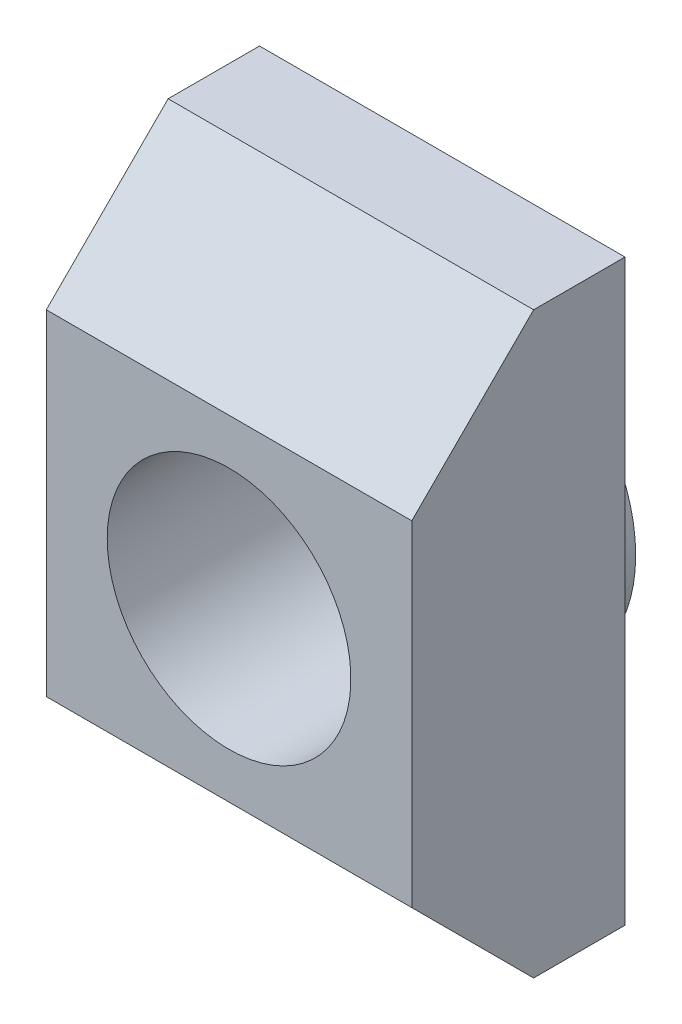
ISO-10303-21;
HEADER;
FILE_DESCRIPTION(('STEP AP214'),'2;1');
FILE_NAME('part.step','',(''),(''),'','','');
FILE_SCHEMA(('AUTOMOTIVE_DESIGN { 1 0 10303 214 1 1 1 1 }'));
ENDSEC;
DATA;
#1=APPLICATION_CONTEXT('core data for automotive mechanical design processes');
#2=APPLICATION_PROTOCOL_DEFINITION('international standard','automotive_design',2000,#1);
#3=PRODUCT_CONTEXT('',#1,'mechanical');
#4=PRODUCT('Part','Part','',(#3));
#5=PRODUCT_RELATED_PRODUCT_CATEGORY('part','',(#4));
#6=PRODUCT_DEFINITION_FORMATION('','',#4);
#7=PRODUCT_DEFINITION_CONTEXT('part definition',#1,'design');
#8=PRODUCT_DEFINITION('design','',#6,#7);
#9=PRODUCT_DEFINITION_SHAPE('','',#8);
#10=(LENGTH_UNIT() NAMED_UNIT(*) SI_UNIT(.MILLI.,.METRE.));
#11=(NAMED_UNIT(*) PLANE_ANGLE_UNIT() SI_UNIT($,.RADIAN.));
#12=(NAMED_UNIT(*) SI_UNIT($,.STERADIAN.) SOLID_ANGLE_UNIT());
#13=UNCERTAINTY_MEASURE_WITH_UNIT(LENGTH_MEASURE(1.E-05),#10,'distance_accuracy_value','');
#14=(GEOMETRIC_REPRESENTATION_CONTEXT(3) GLOBAL_UNCERTAINTY_ASSIGNED_CONTEXT((#13)) GLOBAL_UNIT_ASSIGNED_CONTEXT((#10,
#11,#12)) REPRESENTATION_CONTEXT('',''));
#15=CARTESIAN_POINT('',(0.,0.,0.));
#16=DIRECTION('',(0.,0.,1.));
#17=DIRECTION('',(1.,0.,0.));
#18=AXIS2_PLACEMENT_3D('',#15,#16,#17);
#19=CARTESIAN_POINT('',(0.,0.,2.92902435331399));
#20=DIRECTION('',(0.,0.,-1.));
#21=DIRECTION('',(-1.,0.,0.));
#22=AXIS2_PLACEMENT_3D('',#19,#20,#21);
#23=CYLINDRICAL_SURFACE('',#22,2.);
#24=CARTESIAN_POINT('',(0.,0.,-1.4372505879018));
#25=DIRECTION('',(0.,0.,-1.));
#26=DIRECTION('',(-1.,0.,0.));
#27=AXIS2_PLACEMENT_3D('',#24,#25,#26);
#28=CIRCLE('',#27,2.);
#29=CARTESIAN_POINT('',(-2.,0.,-1.4372505879018));
#30=VERTEX_POINT('',#29);
#31=EDGE_CURVE('E20',#30,#30,#28,.F.);
#32=ORIENTED_EDGE('',*,*,#31,.F.);
#33=EDGE_LOOP('',(#32));
#34=FACE_BOUND('',#33,.T.);
#35=CARTESIAN_POINT('',(0.,0.,2.6627494120982));
#36=DIRECTION('',(0.,0.,-1.));
#37=DIRECTION('',(-1.,0.,0.));
#38=AXIS2_PLACEMENT_3D('',#35,#36,#37);
#39=CIRCLE('',#38,2.);
#40=CARTESIAN_POINT('',(-2.,0.,2.6627494120982));
#41=VERTEX_POINT('',#40);
#42=EDGE_CURVE('E104',#41,#41,#39,.F.);
#43=ORIENTED_EDGE('',*,*,#42,.T.);
#44=EDGE_LOOP('',(#43));
#45=FACE_BOUND('',#44,.T.);
#46=ADVANCED_FACE('F17',(#34,#45),#23,.F.);
#47=CARTESIAN_POINT('',(0.,0.,-1.4372505879018));
#48=DIRECTION('',(0.,0.,-1.));
#49=DIRECTION('',(-1.,0.,0.));
#50=AXIS2_PLACEMENT_3D('',#47,#48,#49);
#51=PLANE('',#50);
#52=ORIENTED_EDGE('',*,*,#31,.T.);
#53=EDGE_LOOP('',(#52));
#54=FACE_BOUND('',#53,.T.);
#55=CARTESIAN_POINT('',(0.,0.,-1.4372505879018));
#56=DIRECTION('',(0.,0.,1.));
#57=DIRECTION('',(1.,0.,0.));
#58=AXIS2_PLACEMENT_3D('',#55,#56,#57);
#59=CIRCLE('',#58,2.57531937284929);
#60=CARTESIAN_POINT('',(2.57531937284929,0.,-1.4372505879018));
#61=VERTEX_POINT('',#60);
#62=EDGE_CURVE('E83',#61,#61,#59,.T.);
#63=ORIENTED_EDGE('',*,*,#62,.F.);
#64=EDGE_LOOP('',(#63));
#65=FACE_BOUND('',#64,.T.);
#66=ADVANCED_FACE('F116',(#54,#65),#51,.T.);
#67=CARTESIAN_POINT('',(3.,4.75,0.662749412098202));
#68=DIRECTION('',(0.,-0.707106781186548,-0.707106781186548));
#69=DIRECTION('',(0.,0.707106781186548,-0.707106781186548));
#70=AXIS2_PLACEMENT_3D('',#67,#68,#69);
#71=PLANE('',#70);
#72=DIRECTION('',(-1.,0.,0.));
#73=VECTOR('',#72,1.);
#74=CARTESIAN_POINT('',(3.,2.75,2.6627494120982));
#75=LINE('',#74,#73);
#76=CARTESIAN_POINT('',(-3.,2.75,2.6627494120982));
#77=VERTEX_POINT('',#76);
#78=CARTESIAN_POINT('',(3.,2.75,2.6627494120982));
#79=VERTEX_POINT('',#78);
#80=EDGE_CURVE('E102',#77,#79,#75,.F.);
#81=ORIENTED_EDGE('',*,*,#80,.T.);
#82=DIRECTION('',(0.,-0.707106781186548,0.707106781186547));
#83=VECTOR('',#82,1.);
#84=CARTESIAN_POINT('',(3.,4.75,0.662749412098202));
#85=LINE('',#84,#83);
#86=CARTESIAN_POINT('',(3.,4.75,0.662749412098202));
#87=VERTEX_POINT('',#86);
#88=EDGE_CURVE('E66',#87,#79,#85,.T.);
#89=ORIENTED_EDGE('',*,*,#88,.F.);
#90=DIRECTION('',(1.,0.,0.));
#91=VECTOR('',#90,1.);
#92=CARTESIAN_POINT('',(3.,4.75,0.662749412098202));
#93=LINE('',#92,#91);
#94=CARTESIAN_POINT('',(-3.,4.75,0.662749412098202));
#95=VERTEX_POINT('',#94);
#96=EDGE_CURVE('E167',#87,#95,#93,.F.);
#97=ORIENTED_EDGE('',*,*,#96,.T.);
#98=DIRECTION('',(0.,-0.707106781186548,0.707106781186547));
#99=VECTOR('',#98,1.);
#100=CARTESIAN_POINT('',(-3.,4.75,0.662749412098202));
#101=LINE('',#100,#99);
#102=EDGE_CURVE('E161',#95,#77,#101,.T.);
#103=ORIENTED_EDGE('',*,*,#102,.T.);
#104=EDGE_LOOP('',(#81,#89,#97,#103));
#105=FACE_BOUND('',#104,.T.);
#106=ADVANCED_FACE('F124',(#105),#71,.F.);
#107=CARTESIAN_POINT('',(3.,2.75,2.6627494120982));
#108=DIRECTION('',(0.,0.,-1.));
#109=DIRECTION('',(-1.,0.,0.));
#110=AXIS2_PLACEMENT_3D('',#107,#108,#109);
#111=PLANE('',#110);
#112=DIRECTION('',(1.,0.,0.));
#113=VECTOR('',#112,1.);
#114=CARTESIAN_POINT('',(3.,-2.75,2.6627494120982));
#115=LINE('',#114,#113);
#116=CARTESIAN_POINT('',(-3.,-2.75,2.6627494120982));
#117=VERTEX_POINT('',#116);
#118=CARTESIAN_POINT('',(3.,-2.75,2.6627494120982));
#119=VERTEX_POINT('',#118);
#120=EDGE_CURVE('E100',#117,#119,#115,.T.);
#121=ORIENTED_EDGE('',*,*,#120,.T.);
#122=DIRECTION('',(0.,1.,0.));
#123=VECTOR('',#122,1.);
#124=CARTESIAN_POINT('',(3.,0.,2.6627494120982));
#125=LINE('',#124,#123);
#126=EDGE_CURVE('E89',#79,#119,#125,.F.);
#127=ORIENTED_EDGE('',*,*,#126,.F.);
#128=ORIENTED_EDGE('',*,*,#80,.F.);
#129=DIRECTION('',(0.,1.,0.));
#130=VECTOR('',#129,1.);
#131=CARTESIAN_POINT('',(-3.,0.,2.6627494120982));
#132=LINE('',#131,#130);
#133=EDGE_CURVE('E171',#77,#117,#132,.F.);
#134=ORIENTED_EDGE('',*,*,#133,.T.);
#135=EDGE_LOOP('',(#121,#127,#128,#134));
#136=FACE_BOUND('',#135,.T.);
#137=ORIENTED_EDGE('',*,*,#42,.F.);
#138=EDGE_LOOP('',(#137));
#139=FACE_BOUND('',#138,.T.);
#140=ADVANCED_FACE('F151',(#136,#139),#111,.F.);
#141=CARTESIAN_POINT('',(3.,-2.75,2.6627494120982));
#142=DIRECTION('',(0.,0.707106781186548,-0.707106781186548));
#143=DIRECTION('',(0.,0.707106781186548,0.707106781186548));
#144=AXIS2_PLACEMENT_3D('',#141,#142,#143);
#145=PLANE('',#144);
#146=DIRECTION('',(1.,0.,0.));
#147=VECTOR('',#146,1.);
#148=CARTESIAN_POINT('',(3.,-4.75,0.662749412098202));
#149=LINE('',#148,#147);
#150=CARTESIAN_POINT('',(-3.,-4.75,0.662749412098201));
#151=VERTEX_POINT('',#150);
#152=CARTESIAN_POINT('',(3.,-4.75,0.662749412098202));
#153=VERTEX_POINT('',#152);
#154=EDGE_CURVE('E72',#151,#153,#149,.T.);
#155=ORIENTED_EDGE('',*,*,#154,.T.);
#156=DIRECTION('',(0.,-0.707106781186548,-0.707106781186547));
#157=VECTOR('',#156,1.);
#158=CARTESIAN_POINT('',(3.,-2.75,2.6627494120982));
#159=LINE('',#158,#157);
#160=EDGE_CURVE('E75',#119,#153,#159,.T.);
#161=ORIENTED_EDGE('',*,*,#160,.F.);
#162=ORIENTED_EDGE('',*,*,#120,.F.);
#163=DIRECTION('',(0.,-0.707106781186548,-0.707106781186547));
#164=VECTOR('',#163,1.);
#165=CARTESIAN_POINT('',(-3.,-2.75,2.6627494120982));
#166=LINE('',#165,#164);
#167=EDGE_CURVE('E77',#117,#151,#166,.T.);
#168=ORIENTED_EDGE('',*,*,#167,.T.);
#169=EDGE_LOOP('',(#155,#161,#162,#168));
#170=FACE_BOUND('',#169,.T.);
#171=ADVANCED_FACE('F74',(#170),#145,.F.);
#172=CARTESIAN_POINT('',(0.,0.,-1.4372505879018));
#173=DIRECTION('',(0.,0.,1.));
#174=DIRECTION('',(1.,0.,0.));
#175=AXIS2_PLACEMENT_3D('',#172,#173,#174);
#176=CYLINDRICAL_SURFACE('',#175,2.57531937284929);
#177=ORIENTED_EDGE('',*,*,#62,.T.);
#178=EDGE_LOOP('',(#177));
#179=FACE_BOUND('',#178,.T.);
#180=CARTESIAN_POINT('',(0.,0.,-0.837250587901798));
#181=DIRECTION('',(0.,0.,1.));
#182=DIRECTION('',(1.,0.,0.));
#183=AXIS2_PLACEMENT_3D('',#180,#181,#182);
#184=CIRCLE('',#183,2.57531937284929);
#185=CARTESIAN_POINT('',(2.57531937284929,0.,-0.837250587901798));
#186=VERTEX_POINT('',#185);
#187=EDGE_CURVE('E105',#186,#186,#184,.F.);
#188=ORIENTED_EDGE('',*,*,#187,.T.);
#189=EDGE_LOOP('',(#188));
#190=FACE_BOUND('',#189,.T.);
#191=ADVANCED_FACE('F145',(#179,#190),#176,.T.);
#192=CARTESIAN_POINT('',(3.,-4.75,0.662749412098202));
#193=DIRECTION('',(0.,1.,0.));
#194=DIRECTION('',(0.,0.,1.));
#195=AXIS2_PLACEMENT_3D('',#192,#193,#194);
#196=PLANE('',#195);
#197=DIRECTION('',(1.,0.,0.));
#198=VECTOR('',#197,1.);
#199=CARTESIAN_POINT('',(3.,-4.75,-0.837250587901798));
#200=LINE('',#199,#198);
#201=CARTESIAN_POINT('',(-3.,-4.75,-0.837250587901798));
#202=VERTEX_POINT('',#201);
#203=CARTESIAN_POINT('',(3.,-4.75,-0.837250587901798));
#204=VERTEX_POINT('',#203);
#205=EDGE_CURVE('E95',#202,#204,#200,.T.);
#206=ORIENTED_EDGE('',*,*,#205,.T.);
#207=DIRECTION('',(0.,0.,-1.));
#208=VECTOR('',#207,1.);
#209=CARTESIAN_POINT('',(3.,-4.75,0.));
#210=LINE('',#209,#208);
#211=EDGE_CURVE('E82',#153,#204,#210,.T.);
#212=ORIENTED_EDGE('',*,*,#211,.F.);
#213=ORIENTED_EDGE('',*,*,#154,.F.);
#214=DIRECTION('',(0.,0.,-1.));
#215=VECTOR('',#214,1.);
#216=CARTESIAN_POINT('',(-3.,-4.75,0.));
#217=LINE('',#216,#215);
#218=EDGE_CURVE('E108',#151,#202,#217,.T.);
#219=ORIENTED_EDGE('',*,*,#218,.T.);
#220=EDGE_LOOP('',(#206,#212,#213,#219));
#221=FACE_BOUND('',#220,.T.);
#222=ADVANCED_FACE('F94',(#221),#196,.F.);
#223=CARTESIAN_POINT('',(3.,0.,0.));
#224=DIRECTION('',(1.,0.,0.));
#225=DIRECTION('',(0.,0.,-1.));
#226=AXIS2_PLACEMENT_3D('',#223,#224,#225);
#227=PLANE('',#226);
#228=ORIENTED_EDGE('',*,*,#126,.T.);
#229=ORIENTED_EDGE('',*,*,#160,.T.);
#230=ORIENTED_EDGE('',*,*,#211,.T.);
#231=DIRECTION('',(0.,1.,0.));
#232=VECTOR('',#231,1.);
#233=CARTESIAN_POINT('',(3.,-4.75,-0.837250587901798));
#234=LINE('',#233,#232);
#235=CARTESIAN_POINT('',(3.,4.75,-0.837250587901798));
#236=VERTEX_POINT('',#235);
#237=EDGE_CURVE('E176',#204,#236,#234,.T.);
#238=ORIENTED_EDGE('',*,*,#237,.T.);
#239=DIRECTION('',(0.,0.,-1.));
#240=VECTOR('',#239,1.);
#241=CARTESIAN_POINT('',(3.,4.75,-0.837250587901798));
#242=LINE('',#241,#240);
#243=EDGE_CURVE('E91',#236,#87,#242,.F.);
#244=ORIENTED_EDGE('',*,*,#243,.T.);
#245=ORIENTED_EDGE('',*,*,#88,.T.);
#246=EDGE_LOOP('',(#228,#229,#230,#238,#244,#245));
#247=FACE_BOUND('',#246,.T.);
#248=ADVANCED_FACE('F85',(#247),#227,.T.);
#249=CARTESIAN_POINT('',(3.,4.75,-0.837250587901798));
#250=DIRECTION('',(0.,-1.,0.));
#251=DIRECTION('',(0.,0.,-1.));
#252=AXIS2_PLACEMENT_3D('',#249,#250,#251);
#253=PLANE('',#252);
#254=ORIENTED_EDGE('',*,*,#96,.F.);
#255=ORIENTED_EDGE('',*,*,#243,.F.);
#256=DIRECTION('',(1.,0.,0.));
#257=VECTOR('',#256,1.);
#258=CARTESIAN_POINT('',(3.,4.75,-0.837250587901798));
#259=LINE('',#258,#257);
#260=CARTESIAN_POINT('',(-3.,4.75,-0.837250587901798));
#261=VERTEX_POINT('',#260);
#262=EDGE_CURVE('E26',#236,#261,#259,.F.);
#263=ORIENTED_EDGE('',*,*,#262,.T.);
#264=DIRECTION('',(0.,0.,-1.));
#265=VECTOR('',#264,1.);
#266=CARTESIAN_POINT('',(-3.,4.75,0.));
#267=LINE('',#266,#265);
#268=EDGE_CURVE('E34',#261,#95,#267,.F.);
#269=ORIENTED_EDGE('',*,*,#268,.T.);
#270=EDGE_LOOP('',(#254,#255,#263,#269));
#271=FACE_BOUND('',#270,.T.);
#272=ADVANCED_FACE('F133',(#271),#253,.F.);
#273=CARTESIAN_POINT('',(-3.,0.,0.));
#274=DIRECTION('',(1.,0.,0.));
#275=DIRECTION('',(0.,0.,-1.));
#276=AXIS2_PLACEMENT_3D('',#273,#274,#275);
#277=PLANE('',#276);
#278=ORIENTED_EDGE('',*,*,#167,.F.);
#279=ORIENTED_EDGE('',*,*,#133,.F.);
#280=ORIENTED_EDGE('',*,*,#102,.F.);
#281=ORIENTED_EDGE('',*,*,#268,.F.);
#282=DIRECTION('',(0.,1.,0.));
#283=VECTOR('',#282,1.);
#284=CARTESIAN_POINT('',(-3.,-4.75,-0.837250587901798));
#285=LINE('',#284,#283);
#286=EDGE_CURVE('E11',#261,#202,#285,.F.);
#287=ORIENTED_EDGE('',*,*,#286,.T.);
#288=ORIENTED_EDGE('',*,*,#218,.F.);
#289=EDGE_LOOP('',(#278,#279,#280,#281,#287,#288));
#290=FACE_BOUND('',#289,.T.);
#291=ADVANCED_FACE('F127',(#290),#277,.F.);
#292=CARTESIAN_POINT('',(3.,-4.75,-0.837250587901798));
#293=DIRECTION('',(0.,0.,1.));
#294=DIRECTION('',(1.,0.,0.));
#295=AXIS2_PLACEMENT_3D('',#292,#293,#294);
#296=PLANE('',#295);
#297=ORIENTED_EDGE('',*,*,#262,.F.);
#298=ORIENTED_EDGE('',*,*,#237,.F.);
#299=ORIENTED_EDGE('',*,*,#205,.F.);
#300=ORIENTED_EDGE('',*,*,#286,.F.);
#301=EDGE_LOOP('',(#297,#298,#299,#300));
#302=FACE_BOUND('',#301,.T.);
#303=ORIENTED_EDGE('',*,*,#187,.F.);
#304=EDGE_LOOP('',(#303));
#305=FACE_BOUND('',#304,.T.);
#306=ADVANCED_FACE('F125',(#302,#305),#296,.F.);
#307=CLOSED_SHELL('',(#46,#66,#106,#140,#171,#191,#222,#248,#272,#291,#306));
#308=MANIFOLD_SOLID_BREP('B1',#307);
#309=ADVANCED_BREP_SHAPE_REPRESENTATION('',(#18,#308),#14);
#310=SHAPE_DEFINITION_REPRESENTATION(#9,#309);
ENDSEC;
END-ISO-10303-21;
